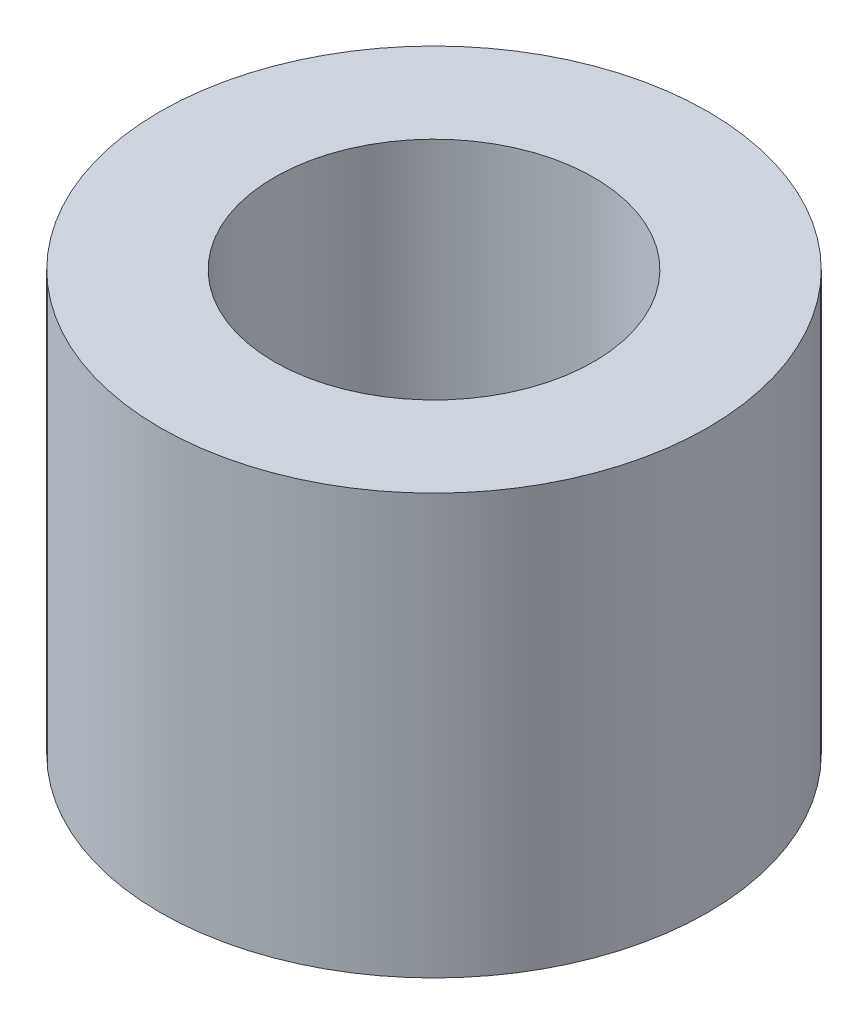
ISO-10303-21;
HEADER;
FILE_DESCRIPTION(('STEP AP214'),'2;1');
FILE_NAME('part.step','',(''),(''),'','','');
FILE_SCHEMA(('AUTOMOTIVE_DESIGN { 1 0 10303 214 1 1 1 1 }'));
ENDSEC;
DATA;
#1=APPLICATION_CONTEXT('core data for automotive mechanical design processes');
#2=APPLICATION_PROTOCOL_DEFINITION('international standard','automotive_design',2000,#1);
#3=PRODUCT_CONTEXT('',#1,'mechanical');
#4=PRODUCT('Part','Part','',(#3));
#5=PRODUCT_RELATED_PRODUCT_CATEGORY('part','',(#4));
#6=PRODUCT_DEFINITION_FORMATION('','',#4);
#7=PRODUCT_DEFINITION_CONTEXT('part definition',#1,'design');
#8=PRODUCT_DEFINITION('design','',#6,#7);
#9=PRODUCT_DEFINITION_SHAPE('','',#8);
#10=(LENGTH_UNIT() NAMED_UNIT(*) SI_UNIT(.MILLI.,.METRE.));
#11=(NAMED_UNIT(*) PLANE_ANGLE_UNIT() SI_UNIT($,.RADIAN.));
#12=(NAMED_UNIT(*) SI_UNIT($,.STERADIAN.) SOLID_ANGLE_UNIT());
#13=UNCERTAINTY_MEASURE_WITH_UNIT(LENGTH_MEASURE(1.E-05),#10,'distance_accuracy_value','');
#14=(GEOMETRIC_REPRESENTATION_CONTEXT(3) GLOBAL_UNCERTAINTY_ASSIGNED_CONTEXT((#13)) GLOBAL_UNIT_ASSIGNED_CONTEXT((#10,
#11,#12)) REPRESENTATION_CONTEXT('',''));
#15=CARTESIAN_POINT('',(0.,0.,0.));
#16=DIRECTION('',(0.,0.,1.));
#17=DIRECTION('',(1.,0.,0.));
#18=AXIS2_PLACEMENT_3D('',#15,#16,#17);
#19=CARTESIAN_POINT('',(0.,4.6,0.));
#20=DIRECTION('',(0.,1.,0.));
#21=DIRECTION('',(0.,0.,1.));
#22=AXIS2_PLACEMENT_3D('',#19,#20,#21);
#23=PLANE('',#22);
#24=CARTESIAN_POINT('',(0.,4.6,0.));
#25=DIRECTION('',(0.,1.,0.));
#26=DIRECTION('',(0.,0.,1.));
#27=AXIS2_PLACEMENT_3D('',#24,#25,#26);
#28=CIRCLE('',#27,3.);
#29=CARTESIAN_POINT('',(0.,4.6,3.));
#30=VERTEX_POINT('',#29);
#31=EDGE_CURVE('E10',#30,#30,#28,.T.);
#32=ORIENTED_EDGE('',*,*,#31,.T.);
#33=EDGE_LOOP('',(#32));
#34=FACE_BOUND('',#33,.T.);
#35=CARTESIAN_POINT('',(0.,4.6,0.));
#36=DIRECTION('',(0.,1.,0.));
#37=DIRECTION('',(0.,0.,1.));
#38=AXIS2_PLACEMENT_3D('',#35,#36,#37);
#39=CIRCLE('',#38,1.75);
#40=CARTESIAN_POINT('',(0.,4.6,1.75));
#41=VERTEX_POINT('',#40);
#42=EDGE_CURVE('E42',#41,#41,#39,.T.);
#43=ORIENTED_EDGE('',*,*,#42,.F.);
#44=EDGE_LOOP('',(#43));
#45=FACE_BOUND('',#44,.T.);
#46=ADVANCED_FACE('F31',(#34,#45),#23,.T.);
#47=CARTESIAN_POINT('',(0.,0.,0.));
#48=DIRECTION('',(0.,1.,0.));
#49=DIRECTION('',(0.,0.,1.));
#50=AXIS2_PLACEMENT_3D('',#47,#48,#49);
#51=PLANE('',#50);
#52=CARTESIAN_POINT('',(0.,0.,0.));
#53=DIRECTION('',(0.,1.,0.));
#54=DIRECTION('',(0.,0.,1.));
#55=AXIS2_PLACEMENT_3D('',#52,#53,#54);
#56=CIRCLE('',#55,3.);
#57=CARTESIAN_POINT('',(0.,0.,3.));
#58=VERTEX_POINT('',#57);
#59=EDGE_CURVE('E35',#58,#58,#56,.T.);
#60=ORIENTED_EDGE('',*,*,#59,.F.);
#61=EDGE_LOOP('',(#60));
#62=FACE_BOUND('',#61,.T.);
#63=CARTESIAN_POINT('',(0.,0.,0.));
#64=DIRECTION('',(0.,1.,0.));
#65=DIRECTION('',(0.,0.,1.));
#66=AXIS2_PLACEMENT_3D('',#63,#64,#65);
#67=CIRCLE('',#66,1.75);
#68=CARTESIAN_POINT('',(0.,0.,1.75));
#69=VERTEX_POINT('',#68);
#70=EDGE_CURVE('E44',#69,#69,#67,.T.);
#71=ORIENTED_EDGE('',*,*,#70,.T.);
#72=EDGE_LOOP('',(#71));
#73=FACE_BOUND('',#72,.T.);
#74=ADVANCED_FACE('F54',(#62,#73),#51,.F.);
#75=CARTESIAN_POINT('',(0.,4.6,0.));
#76=DIRECTION('',(0.,-1.,0.));
#77=DIRECTION('',(0.,0.,-1.));
#78=AXIS2_PLACEMENT_3D('',#75,#76,#77);
#79=CYLINDRICAL_SURFACE('',#78,3.);
#80=ORIENTED_EDGE('',*,*,#31,.F.);
#81=EDGE_LOOP('',(#80));
#82=FACE_BOUND('',#81,.T.);
#83=ORIENTED_EDGE('',*,*,#59,.T.);
#84=EDGE_LOOP('',(#83));
#85=FACE_BOUND('',#84,.T.);
#86=ADVANCED_FACE('F33',(#82,#85),#79,.T.);
#87=CARTESIAN_POINT('',(0.,4.6,0.));
#88=DIRECTION('',(0.,-1.,0.));
#89=DIRECTION('',(0.,0.,-1.));
#90=AXIS2_PLACEMENT_3D('',#87,#88,#89);
#91=CYLINDRICAL_SURFACE('',#90,1.75);
#92=ORIENTED_EDGE('',*,*,#42,.T.);
#93=EDGE_LOOP('',(#92));
#94=FACE_BOUND('',#93,.T.);
#95=ORIENTED_EDGE('',*,*,#70,.F.);
#96=EDGE_LOOP('',(#95));
#97=FACE_BOUND('',#96,.T.);
#98=ADVANCED_FACE('F50',(#94,#97),#91,.F.);
#99=CLOSED_SHELL('',(#46,#74,#86,#98));
#100=MANIFOLD_SOLID_BREP('B2',#99);
#101=ADVANCED_BREP_SHAPE_REPRESENTATION('',(#18,#100),#14);
#102=SHAPE_DEFINITION_REPRESENTATION(#9,#101);
ENDSEC;
END-ISO-10303-21;
